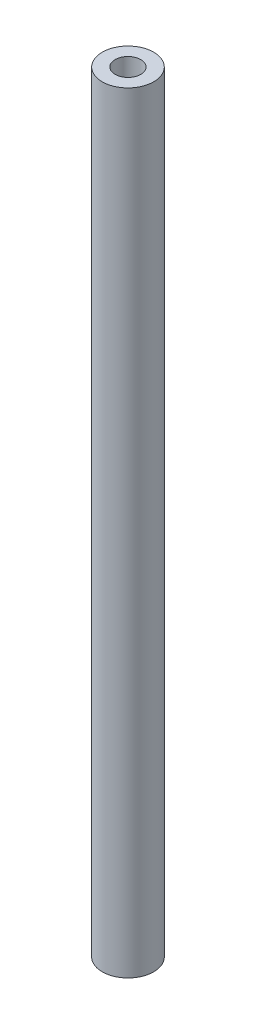
ISO-10303-21;
HEADER;
FILE_DESCRIPTION(('STEP AP214'),'2;1');
FILE_NAME('part.step','',(''),(''),'','','');
FILE_SCHEMA(('AUTOMOTIVE_DESIGN { 1 0 10303 214 1 1 1 1 }'));
ENDSEC;
DATA;
#1=APPLICATION_CONTEXT('core data for automotive mechanical design processes');
#2=APPLICATION_PROTOCOL_DEFINITION('international standard','automotive_design',2000,#1);
#3=PRODUCT_CONTEXT('',#1,'mechanical');
#4=PRODUCT('Part','Part','',(#3));
#5=PRODUCT_RELATED_PRODUCT_CATEGORY('part','',(#4));
#6=PRODUCT_DEFINITION_FORMATION('','',#4);
#7=PRODUCT_DEFINITION_CONTEXT('part definition',#1,'design');
#8=PRODUCT_DEFINITION('design','',#6,#7);
#9=PRODUCT_DEFINITION_SHAPE('','',#8);
#10=(LENGTH_UNIT() NAMED_UNIT(*) SI_UNIT(.MILLI.,.METRE.));
#11=(NAMED_UNIT(*) PLANE_ANGLE_UNIT() SI_UNIT($,.RADIAN.));
#12=(NAMED_UNIT(*) SI_UNIT($,.STERADIAN.) SOLID_ANGLE_UNIT());
#13=UNCERTAINTY_MEASURE_WITH_UNIT(LENGTH_MEASURE(1.E-05),#10,'distance_accuracy_value','');
#14=(GEOMETRIC_REPRESENTATION_CONTEXT(3) GLOBAL_UNCERTAINTY_ASSIGNED_CONTEXT((#13)) GLOBAL_UNIT_ASSIGNED_CONTEXT((#10,
#11,#12)) REPRESENTATION_CONTEXT('',''));
#15=CARTESIAN_POINT('',(0.,0.,0.));
#16=DIRECTION('',(0.,0.,1.));
#17=DIRECTION('',(1.,0.,0.));
#18=AXIS2_PLACEMENT_3D('',#15,#16,#17);
#19=CARTESIAN_POINT('',(0.,381.,0.));
#20=DIRECTION('',(0.,1.,0.));
#21=DIRECTION('',(0.,0.,1.));
#22=AXIS2_PLACEMENT_3D('',#19,#20,#21);
#23=PLANE('',#22);
#24=CARTESIAN_POINT('',(0.,381.,0.));
#25=DIRECTION('',(0.,1.,0.));
#26=DIRECTION('',(0.,0.,1.));
#27=AXIS2_PLACEMENT_3D('',#24,#25,#26);
#28=CIRCLE('',#27,12.7);
#29=CARTESIAN_POINT('',(0.,381.,12.7));
#30=VERTEX_POINT('',#29);
#31=EDGE_CURVE('E11',#30,#30,#28,.T.);
#32=ORIENTED_EDGE('',*,*,#31,.T.);
#33=EDGE_LOOP('',(#32));
#34=FACE_BOUND('',#33,.T.);
#35=CARTESIAN_POINT('',(0.,381.,0.));
#36=DIRECTION('',(0.,1.,0.));
#37=DIRECTION('',(0.,0.,1.));
#38=AXIS2_PLACEMENT_3D('',#35,#36,#37);
#39=CIRCLE('',#38,6.35);
#40=CARTESIAN_POINT('',(0.,381.,6.35));
#41=VERTEX_POINT('',#40);
#42=EDGE_CURVE('E60',#41,#41,#39,.T.);
#43=ORIENTED_EDGE('',*,*,#42,.F.);
#44=EDGE_LOOP('',(#43));
#45=FACE_BOUND('',#44,.T.);
#46=ADVANCED_FACE('F47',(#34,#45),#23,.T.);
#47=CARTESIAN_POINT('',(0.,0.,0.));
#48=DIRECTION('',(0.,1.,0.));
#49=DIRECTION('',(0.,0.,1.));
#50=AXIS2_PLACEMENT_3D('',#47,#48,#49);
#51=PLANE('',#50);
#52=CARTESIAN_POINT('',(0.,0.,0.));
#53=DIRECTION('',(0.,1.,0.));
#54=DIRECTION('',(0.,0.,1.));
#55=AXIS2_PLACEMENT_3D('',#52,#53,#54);
#56=CIRCLE('',#55,12.7);
#57=CARTESIAN_POINT('',(0.,0.,12.7));
#58=VERTEX_POINT('',#57);
#59=EDGE_CURVE('E51',#58,#58,#56,.T.);
#60=ORIENTED_EDGE('',*,*,#59,.F.);
#61=EDGE_LOOP('',(#60));
#62=FACE_BOUND('',#61,.T.);
#63=CARTESIAN_POINT('',(0.,0.,0.));
#64=DIRECTION('',(0.,1.,0.));
#65=DIRECTION('',(0.,0.,1.));
#66=AXIS2_PLACEMENT_3D('',#63,#64,#65);
#67=CIRCLE('',#66,6.35);
#68=CARTESIAN_POINT('',(0.,0.,6.35));
#69=VERTEX_POINT('',#68);
#70=EDGE_CURVE('E62',#69,#69,#67,.T.);
#71=ORIENTED_EDGE('',*,*,#70,.T.);
#72=EDGE_LOOP('',(#71));
#73=FACE_BOUND('',#72,.T.);
#74=ADVANCED_FACE('F74',(#62,#73),#51,.F.);
#75=CARTESIAN_POINT('',(0.,381.,0.));
#76=DIRECTION('',(0.,-1.,0.));
#77=DIRECTION('',(0.,0.,-1.));
#78=AXIS2_PLACEMENT_3D('',#75,#76,#77);
#79=CYLINDRICAL_SURFACE('',#78,12.7);
#80=ORIENTED_EDGE('',*,*,#31,.F.);
#81=EDGE_LOOP('',(#80));
#82=FACE_BOUND('',#81,.T.);
#83=ORIENTED_EDGE('',*,*,#59,.T.);
#84=EDGE_LOOP('',(#83));
#85=FACE_BOUND('',#84,.T.);
#86=ADVANCED_FACE('F49',(#82,#85),#79,.T.);
#87=CARTESIAN_POINT('',(0.,381.,0.));
#88=DIRECTION('',(0.,-1.,0.));
#89=DIRECTION('',(0.,0.,-1.));
#90=AXIS2_PLACEMENT_3D('',#87,#88,#89);
#91=CYLINDRICAL_SURFACE('',#90,6.35);
#92=ORIENTED_EDGE('',*,*,#42,.T.);
#93=EDGE_LOOP('',(#92));
#94=FACE_BOUND('',#93,.T.);
#95=ORIENTED_EDGE('',*,*,#70,.F.);
#96=EDGE_LOOP('',(#95));
#97=FACE_BOUND('',#96,.T.);
#98=ADVANCED_FACE('F70',(#94,#97),#91,.F.);
#99=CLOSED_SHELL('',(#46,#74,#86,#98));
#100=MANIFOLD_SOLID_BREP('B2',#99);
#101=ADVANCED_BREP_SHAPE_REPRESENTATION('',(#18,#100),#14);
#102=SHAPE_DEFINITION_REPRESENTATION(#9,#101);
ENDSEC;
END-ISO-10303-21;
